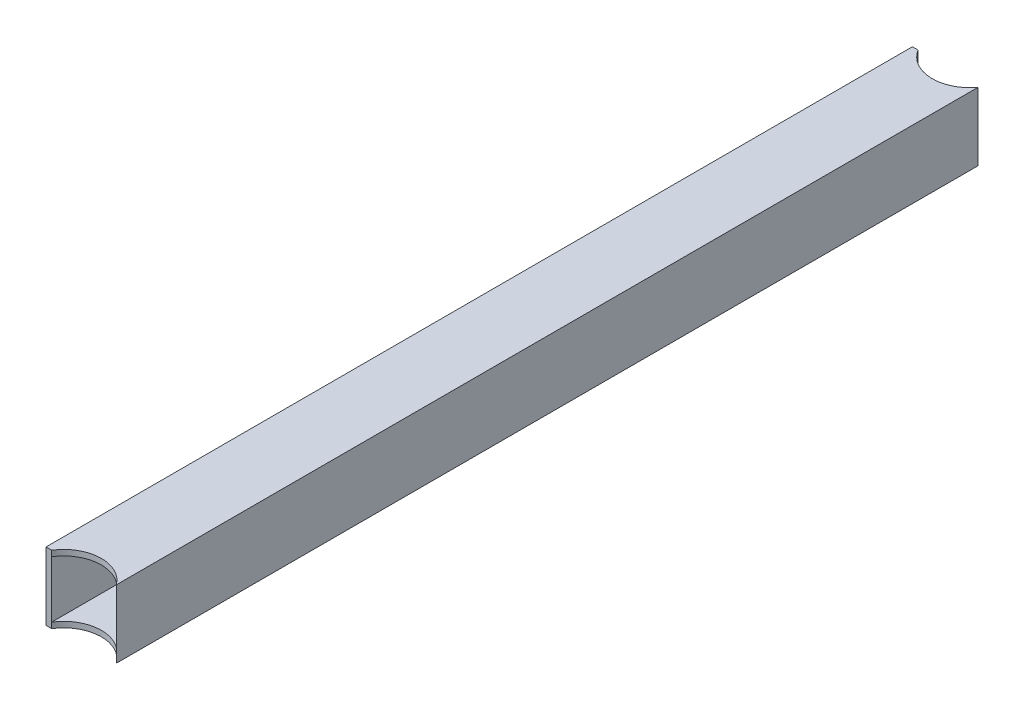
ISO-10303-21;
HEADER;
FILE_DESCRIPTION(('STEP AP214'),'2;1');
FILE_NAME('part.step','',(''),(''),'','','');
FILE_SCHEMA(('AUTOMOTIVE_DESIGN { 1 0 10303 214 1 1 1 1 }'));
ENDSEC;
DATA;
#1=APPLICATION_CONTEXT('core data for automotive mechanical design processes');
#2=APPLICATION_PROTOCOL_DEFINITION('international standard','automotive_design',2000,#1);
#3=PRODUCT_CONTEXT('',#1,'mechanical');
#4=PRODUCT('Part','Part','',(#3));
#5=PRODUCT_RELATED_PRODUCT_CATEGORY('part','',(#4));
#6=PRODUCT_DEFINITION_FORMATION('','',#4);
#7=PRODUCT_DEFINITION_CONTEXT('part definition',#1,'design');
#8=PRODUCT_DEFINITION('design','',#6,#7);
#9=PRODUCT_DEFINITION_SHAPE('','',#8);
#10=(LENGTH_UNIT() NAMED_UNIT(*) SI_UNIT(.MILLI.,.METRE.));
#11=(NAMED_UNIT(*) PLANE_ANGLE_UNIT() SI_UNIT($,.RADIAN.));
#12=(NAMED_UNIT(*) SI_UNIT($,.STERADIAN.) SOLID_ANGLE_UNIT());
#13=UNCERTAINTY_MEASURE_WITH_UNIT(LENGTH_MEASURE(1.E-05),#10,'distance_accuracy_value','');
#14=(GEOMETRIC_REPRESENTATION_CONTEXT(3) GLOBAL_UNCERTAINTY_ASSIGNED_CONTEXT((#13)) GLOBAL_UNIT_ASSIGNED_CONTEXT((#10,
#11,#12)) REPRESENTATION_CONTEXT('',''));
#15=CARTESIAN_POINT('',(0.,0.,0.));
#16=DIRECTION('',(0.,0.,1.));
#17=DIRECTION('',(1.,0.,0.));
#18=AXIS2_PLACEMENT_3D('',#15,#16,#17);
#19=CARTESIAN_POINT('',(21.082,0.,254.));
#20=DIRECTION('',(0.,1.,0.));
#21=DIRECTION('',(0.,0.,1.));
#22=AXIS2_PLACEMENT_3D('',#19,#20,#21);
#23=CYLINDRICAL_SURFACE('',#22,21.082);
#24=DIRECTION('',(0.,1.,0.));
#25=VECTOR('',#24,1.);
#26=CARTESIAN_POINT('',(3.17500000000001,0.,242.873901177861));
#27=LINE('',#26,#25);
#28=CARTESIAN_POINT('',(3.17500000000001,3.175,242.873901177861));
#29=VERTEX_POINT('',#28);
#30=CARTESIAN_POINT('',(3.17500000000001,34.925,242.873901177861));
#31=VERTEX_POINT('',#30);
#32=EDGE_CURVE('E150',#29,#31,#27,.T.);
#33=ORIENTED_EDGE('',*,*,#32,.T.);
#34=CARTESIAN_POINT('',(21.082,34.925,254.));
#35=DIRECTION('',(0.,-1.,0.));
#36=DIRECTION('',(0.,0.,-1.));
#37=AXIS2_PLACEMENT_3D('',#34,#35,#36);
#38=CIRCLE('',#37,21.082);
#39=CARTESIAN_POINT('',(34.925,34.925,238.099620287553));
#40=VERTEX_POINT('',#39);
#41=EDGE_CURVE('E11',#31,#40,#38,.T.);
#42=ORIENTED_EDGE('',*,*,#41,.T.);
#43=DIRECTION('',(0.,1.,0.));
#44=VECTOR('',#43,1.);
#45=CARTESIAN_POINT('',(34.925,0.,238.099620287553));
#46=LINE('',#45,#44);
#47=CARTESIAN_POINT('',(34.925,3.175,238.099620287553));
#48=VERTEX_POINT('',#47);
#49=EDGE_CURVE('E154',#40,#48,#46,.F.);
#50=ORIENTED_EDGE('',*,*,#49,.T.);
#51=CARTESIAN_POINT('',(21.082,3.175,254.));
#52=DIRECTION('',(0.,1.,0.));
#53=DIRECTION('',(0.,0.,1.));
#54=AXIS2_PLACEMENT_3D('',#51,#52,#53);
#55=CIRCLE('',#54,21.082);
#56=EDGE_CURVE('E152',#48,#29,#55,.T.);
#57=ORIENTED_EDGE('',*,*,#56,.T.);
#58=EDGE_LOOP('',(#33,#42,#50,#57));
#59=FACE_BOUND('',#58,.T.);
#60=DIRECTION('',(0.,1.,0.));
#61=VECTOR('',#60,1.);
#62=CARTESIAN_POINT('',(3.16655784106909,0.,242.8875));
#63=LINE('',#62,#61);
#64=CARTESIAN_POINT('',(3.16655784106909,0.,242.8875));
#65=VERTEX_POINT('',#64);
#66=CARTESIAN_POINT('',(3.16655784106909,38.1,242.8875));
#67=VERTEX_POINT('',#66);
#68=EDGE_CURVE('E114',#65,#67,#63,.T.);
#69=ORIENTED_EDGE('',*,*,#68,.F.);
#70=CARTESIAN_POINT('',(21.082,0.,254.));
#71=DIRECTION('',(0.,1.,0.));
#72=DIRECTION('',(0.,0.,1.));
#73=AXIS2_PLACEMENT_3D('',#70,#71,#72);
#74=CIRCLE('',#73,21.082);
#75=CARTESIAN_POINT('',(38.1,0.,241.556592106661));
#76=VERTEX_POINT('',#75);
#77=EDGE_CURVE('E122',#76,#65,#74,.T.);
#78=ORIENTED_EDGE('',*,*,#77,.F.);
#79=DIRECTION('',(0.,1.,0.));
#80=VECTOR('',#79,1.);
#81=CARTESIAN_POINT('',(38.1,0.,241.556592106661));
#82=LINE('',#81,#80);
#83=CARTESIAN_POINT('',(38.1,38.1,241.556592106661));
#84=VERTEX_POINT('',#83);
#85=EDGE_CURVE('E147',#84,#76,#82,.F.);
#86=ORIENTED_EDGE('',*,*,#85,.F.);
#87=CARTESIAN_POINT('',(21.082,38.1,254.));
#88=DIRECTION('',(0.,1.,0.));
#89=DIRECTION('',(0.,0.,1.));
#90=AXIS2_PLACEMENT_3D('',#87,#88,#89);
#91=CIRCLE('',#90,21.082);
#92=EDGE_CURVE('E169',#84,#67,#91,.T.);
#93=ORIENTED_EDGE('',*,*,#92,.T.);
#94=EDGE_LOOP('',(#69,#78,#86,#93));
#95=FACE_BOUND('',#94,.T.);
#96=ADVANCED_FACE('F32',(#59,#95),#23,.F.);
#97=CARTESIAN_POINT('',(0.,38.1,1270.));
#98=DIRECTION('',(0.,-1.,0.));
#99=DIRECTION('',(0.,0.,-1.));
#100=AXIS2_PLACEMENT_3D('',#97,#98,#99);
#101=PLANE('',#100);
#102=DIRECTION('',(1.,0.,0.));
#103=VECTOR('',#102,1.);
#104=CARTESIAN_POINT('',(0.,38.1,242.8875));
#105=LINE('',#104,#103);
#106=CARTESIAN_POINT('',(0.,38.1,242.8875));
#107=VERTEX_POINT('',#106);
#108=EDGE_CURVE('E47',#107,#67,#105,.T.);
#109=ORIENTED_EDGE('',*,*,#108,.T.);
#110=ORIENTED_EDGE('',*,*,#92,.F.);
#111=DIRECTION('',(0.,0.,-1.));
#112=VECTOR('',#111,1.);
#113=CARTESIAN_POINT('',(38.1,38.1,1270.));
#114=LINE('',#113,#112);
#115=CARTESIAN_POINT('',(38.1,38.1,-241.556592106662));
#116=VERTEX_POINT('',#115);
#117=EDGE_CURVE('E128',#84,#116,#114,.T.);
#118=ORIENTED_EDGE('',*,*,#117,.T.);
#119=CARTESIAN_POINT('',(21.0819999999997,38.1,-254.));
#120=DIRECTION('',(0.,1.,0.));
#121=DIRECTION('',(0.,0.,-1.));
#122=AXIS2_PLACEMENT_3D('',#119,#120,#121);
#123=CIRCLE('',#122,21.0819999999999);
#124=CARTESIAN_POINT('',(3.16655784106884,38.1,-242.8875));
#125=VERTEX_POINT('',#124);
#126=EDGE_CURVE('E165',#125,#116,#123,.T.);
#127=ORIENTED_EDGE('',*,*,#126,.F.);
#128=DIRECTION('',(1.,0.,0.));
#129=VECTOR('',#128,1.);
#130=CARTESIAN_POINT('',(0.,38.1,-242.8875));
#131=LINE('',#130,#129);
#132=CARTESIAN_POINT('',(0.,38.1,-242.8875));
#133=VERTEX_POINT('',#132);
#134=EDGE_CURVE('E177',#133,#125,#131,.T.);
#135=ORIENTED_EDGE('',*,*,#134,.F.);
#136=DIRECTION('',(0.,0.,-1.));
#137=VECTOR('',#136,1.);
#138=CARTESIAN_POINT('',(0.,38.1,1270.));
#139=LINE('',#138,#137);
#140=EDGE_CURVE('E133',#107,#133,#139,.T.);
#141=ORIENTED_EDGE('',*,*,#140,.F.);
#142=EDGE_LOOP('',(#109,#110,#118,#127,#135,#141));
#143=FACE_BOUND('',#142,.T.);
#144=ADVANCED_FACE('F183',(#143),#101,.F.);
#145=CARTESIAN_POINT('',(0.,0.,1270.));
#146=DIRECTION('',(0.,1.,0.));
#147=DIRECTION('',(0.,0.,1.));
#148=AXIS2_PLACEMENT_3D('',#145,#146,#147);
#149=PLANE('',#148);
#150=DIRECTION('',(1.,0.,0.));
#151=VECTOR('',#150,1.);
#152=CARTESIAN_POINT('',(0.,0.,242.8875));
#153=LINE('',#152,#151);
#154=CARTESIAN_POINT('',(0.,0.,242.8875));
#155=VERTEX_POINT('',#154);
#156=EDGE_CURVE('E108',#155,#65,#153,.T.);
#157=ORIENTED_EDGE('',*,*,#156,.F.);
#158=DIRECTION('',(0.,0.,-1.));
#159=VECTOR('',#158,1.);
#160=CARTESIAN_POINT('',(0.,0.,1270.));
#161=LINE('',#160,#159);
#162=CARTESIAN_POINT('',(0.,0.,-242.887499999999));
#163=VERTEX_POINT('',#162);
#164=EDGE_CURVE('E120',#155,#163,#161,.T.);
#165=ORIENTED_EDGE('',*,*,#164,.T.);
#166=DIRECTION('',(1.,0.,0.));
#167=VECTOR('',#166,1.);
#168=CARTESIAN_POINT('',(0.,0.,-242.8875));
#169=LINE('',#168,#167);
#170=CARTESIAN_POINT('',(3.16655784106884,0.,-242.8875));
#171=VERTEX_POINT('',#170);
#172=EDGE_CURVE('E55',#163,#171,#169,.T.);
#173=ORIENTED_EDGE('',*,*,#172,.T.);
#174=CARTESIAN_POINT('',(21.0819999999997,0.,-254.));
#175=DIRECTION('',(0.,1.,0.));
#176=DIRECTION('',(0.,0.,-1.));
#177=AXIS2_PLACEMENT_3D('',#174,#175,#176);
#178=CIRCLE('',#177,21.0819999999999);
#179=CARTESIAN_POINT('',(38.1,0.,-241.556592106662));
#180=VERTEX_POINT('',#179);
#181=EDGE_CURVE('E167',#171,#180,#178,.T.);
#182=ORIENTED_EDGE('',*,*,#181,.T.);
#183=DIRECTION('',(0.,0.,-1.));
#184=VECTOR('',#183,1.);
#185=CARTESIAN_POINT('',(38.1,0.,1270.));
#186=LINE('',#185,#184);
#187=EDGE_CURVE('E125',#76,#180,#186,.T.);
#188=ORIENTED_EDGE('',*,*,#187,.F.);
#189=ORIENTED_EDGE('',*,*,#77,.T.);
#190=EDGE_LOOP('',(#157,#165,#173,#182,#188,#189));
#191=FACE_BOUND('',#190,.T.);
#192=ADVANCED_FACE('F119',(#191),#149,.F.);
#193=CARTESIAN_POINT('',(0.,0.,1270.));
#194=DIRECTION('',(1.,0.,0.));
#195=DIRECTION('',(0.,0.,-1.));
#196=AXIS2_PLACEMENT_3D('',#193,#194,#195);
#197=PLANE('',#196);
#198=DIRECTION('',(0.,1.,0.));
#199=VECTOR('',#198,1.);
#200=CARTESIAN_POINT('',(0.,0.,242.8875));
#201=LINE('',#200,#199);
#202=EDGE_CURVE('E105',#155,#107,#201,.T.);
#203=ORIENTED_EDGE('',*,*,#202,.T.);
#204=ORIENTED_EDGE('',*,*,#140,.T.);
#205=DIRECTION('',(0.,1.,0.));
#206=VECTOR('',#205,1.);
#207=CARTESIAN_POINT('',(0.,0.,-242.8875));
#208=LINE('',#207,#206);
#209=EDGE_CURVE('E124',#163,#133,#208,.T.);
#210=ORIENTED_EDGE('',*,*,#209,.F.);
#211=ORIENTED_EDGE('',*,*,#164,.F.);
#212=EDGE_LOOP('',(#203,#204,#210,#211));
#213=FACE_BOUND('',#212,.T.);
#214=ADVANCED_FACE('F34',(#213),#197,.F.);
#215=CARTESIAN_POINT('',(3.175,34.925,1270.));
#216=DIRECTION('',(0.,-1.,0.));
#217=DIRECTION('',(0.,0.,-1.));
#218=AXIS2_PLACEMENT_3D('',#215,#216,#217);
#219=PLANE('',#218);
#220=ORIENTED_EDGE('',*,*,#41,.F.);
#221=DIRECTION('',(0.,0.,-1.));
#222=VECTOR('',#221,1.);
#223=CARTESIAN_POINT('',(3.175,34.925,1270.));
#224=LINE('',#223,#222);
#225=CARTESIAN_POINT('',(3.17500000000001,34.925,-242.873901177861));
#226=VERTEX_POINT('',#225);
#227=EDGE_CURVE('E144',#31,#226,#224,.T.);
#228=ORIENTED_EDGE('',*,*,#227,.T.);
#229=CARTESIAN_POINT('',(21.0819999999997,34.925,-254.));
#230=DIRECTION('',(0.,-1.,0.));
#231=DIRECTION('',(0.,0.,-1.));
#232=AXIS2_PLACEMENT_3D('',#229,#230,#231);
#233=CIRCLE('',#232,21.0819999999999);
#234=CARTESIAN_POINT('',(34.925,34.925,-238.099620287553));
#235=VERTEX_POINT('',#234);
#236=EDGE_CURVE('E40',#235,#226,#233,.T.);
#237=ORIENTED_EDGE('',*,*,#236,.F.);
#238=DIRECTION('',(0.,0.,-1.));
#239=VECTOR('',#238,1.);
#240=CARTESIAN_POINT('',(34.925,34.925,1270.));
#241=LINE('',#240,#239);
#242=EDGE_CURVE('E141',#40,#235,#241,.T.);
#243=ORIENTED_EDGE('',*,*,#242,.F.);
#244=EDGE_LOOP('',(#220,#228,#237,#243));
#245=FACE_BOUND('',#244,.T.);
#246=ADVANCED_FACE('F215',(#245),#219,.T.);
#247=CARTESIAN_POINT('',(34.925,3.175,1270.));
#248=DIRECTION('',(-1.,0.,0.));
#249=DIRECTION('',(0.,0.,1.));
#250=AXIS2_PLACEMENT_3D('',#247,#248,#249);
#251=PLANE('',#250);
#252=ORIENTED_EDGE('',*,*,#49,.F.);
#253=ORIENTED_EDGE('',*,*,#242,.T.);
#254=DIRECTION('',(0.,1.,0.));
#255=VECTOR('',#254,1.);
#256=CARTESIAN_POINT('',(34.925,0.,-238.099620287553));
#257=LINE('',#256,#255);
#258=CARTESIAN_POINT('',(34.925,3.175,-238.099620287553));
#259=VERTEX_POINT('',#258);
#260=EDGE_CURVE('E162',#259,#235,#257,.T.);
#261=ORIENTED_EDGE('',*,*,#260,.F.);
#262=DIRECTION('',(0.,0.,-1.));
#263=VECTOR('',#262,1.);
#264=CARTESIAN_POINT('',(34.925,3.175,1270.));
#265=LINE('',#264,#263);
#266=EDGE_CURVE('E138',#48,#259,#265,.T.);
#267=ORIENTED_EDGE('',*,*,#266,.F.);
#268=EDGE_LOOP('',(#252,#253,#261,#267));
#269=FACE_BOUND('',#268,.T.);
#270=ADVANCED_FACE('F218',(#269),#251,.T.);
#271=CARTESIAN_POINT('',(3.175,3.175,1270.));
#272=DIRECTION('',(0.,1.,0.));
#273=DIRECTION('',(0.,0.,1.));
#274=AXIS2_PLACEMENT_3D('',#271,#272,#273);
#275=PLANE('',#274);
#276=ORIENTED_EDGE('',*,*,#56,.F.);
#277=ORIENTED_EDGE('',*,*,#266,.T.);
#278=CARTESIAN_POINT('',(21.0819999999997,3.175,-254.));
#279=DIRECTION('',(0.,1.,0.));
#280=DIRECTION('',(0.,0.,1.));
#281=AXIS2_PLACEMENT_3D('',#278,#279,#280);
#282=CIRCLE('',#281,21.0819999999999);
#283=CARTESIAN_POINT('',(3.17500000000001,3.175,-242.873901177861));
#284=VERTEX_POINT('',#283);
#285=EDGE_CURVE('E161',#284,#259,#282,.T.);
#286=ORIENTED_EDGE('',*,*,#285,.F.);
#287=DIRECTION('',(0.,0.,-1.));
#288=VECTOR('',#287,1.);
#289=CARTESIAN_POINT('',(3.175,3.175,1270.));
#290=LINE('',#289,#288);
#291=EDGE_CURVE('E135',#29,#284,#290,.T.);
#292=ORIENTED_EDGE('',*,*,#291,.F.);
#293=EDGE_LOOP('',(#276,#277,#286,#292));
#294=FACE_BOUND('',#293,.T.);
#295=ADVANCED_FACE('F222',(#294),#275,.T.);
#296=CARTESIAN_POINT('',(3.175,3.175,1270.));
#297=DIRECTION('',(1.,0.,0.));
#298=DIRECTION('',(0.,0.,-1.));
#299=AXIS2_PLACEMENT_3D('',#296,#297,#298);
#300=PLANE('',#299);
#301=ORIENTED_EDGE('',*,*,#32,.F.);
#302=ORIENTED_EDGE('',*,*,#291,.T.);
#303=DIRECTION('',(0.,1.,0.));
#304=VECTOR('',#303,1.);
#305=CARTESIAN_POINT('',(3.17500000000001,0.,-242.873901177861));
#306=LINE('',#305,#304);
#307=EDGE_CURVE('E159',#226,#284,#306,.F.);
#308=ORIENTED_EDGE('',*,*,#307,.F.);
#309=ORIENTED_EDGE('',*,*,#227,.F.);
#310=EDGE_LOOP('',(#301,#302,#308,#309));
#311=FACE_BOUND('',#310,.T.);
#312=ADVANCED_FACE('F214',(#311),#300,.T.);
#313=CARTESIAN_POINT('',(21.0819999999997,0.,-254.));
#314=DIRECTION('',(0.,1.,0.));
#315=DIRECTION('',(0.,0.,1.));
#316=AXIS2_PLACEMENT_3D('',#313,#314,#315);
#317=CYLINDRICAL_SURFACE('',#316,21.0819999999999);
#318=ORIENTED_EDGE('',*,*,#181,.F.);
#319=DIRECTION('',(0.,1.,0.));
#320=VECTOR('',#319,1.);
#321=CARTESIAN_POINT('',(3.16655784106884,0.,-242.8875));
#322=LINE('',#321,#320);
#323=EDGE_CURVE('E174',#171,#125,#322,.T.);
#324=ORIENTED_EDGE('',*,*,#323,.T.);
#325=ORIENTED_EDGE('',*,*,#126,.T.);
#326=DIRECTION('',(0.,1.,0.));
#327=VECTOR('',#326,1.);
#328=CARTESIAN_POINT('',(38.1,0.,-241.556592106662));
#329=LINE('',#328,#327);
#330=EDGE_CURVE('E156',#180,#116,#329,.T.);
#331=ORIENTED_EDGE('',*,*,#330,.F.);
#332=EDGE_LOOP('',(#318,#324,#325,#331));
#333=FACE_BOUND('',#332,.T.);
#334=ORIENTED_EDGE('',*,*,#307,.T.);
#335=ORIENTED_EDGE('',*,*,#285,.T.);
#336=ORIENTED_EDGE('',*,*,#260,.T.);
#337=ORIENTED_EDGE('',*,*,#236,.T.);
#338=EDGE_LOOP('',(#334,#335,#336,#337));
#339=FACE_BOUND('',#338,.T.);
#340=ADVANCED_FACE('F192',(#333,#339),#317,.F.);
#341=CARTESIAN_POINT('',(38.1,0.,1270.));
#342=DIRECTION('',(-1.,0.,0.));
#343=DIRECTION('',(0.,0.,1.));
#344=AXIS2_PLACEMENT_3D('',#341,#342,#343);
#345=PLANE('',#344);
#346=ORIENTED_EDGE('',*,*,#117,.F.);
#347=ORIENTED_EDGE('',*,*,#85,.T.);
#348=ORIENTED_EDGE('',*,*,#187,.T.);
#349=ORIENTED_EDGE('',*,*,#330,.T.);
#350=EDGE_LOOP('',(#346,#347,#348,#349));
#351=FACE_BOUND('',#350,.T.);
#352=ADVANCED_FACE('F188',(#351),#345,.F.);
#353=CARTESIAN_POINT('',(0.,0.,-242.8875));
#354=DIRECTION('',(0.,0.,1.));
#355=DIRECTION('',(1.,0.,0.));
#356=AXIS2_PLACEMENT_3D('',#353,#354,#355);
#357=PLANE('',#356);
#358=ORIENTED_EDGE('',*,*,#134,.T.);
#359=ORIENTED_EDGE('',*,*,#323,.F.);
#360=ORIENTED_EDGE('',*,*,#172,.F.);
#361=ORIENTED_EDGE('',*,*,#209,.T.);
#362=EDGE_LOOP('',(#358,#359,#360,#361));
#363=FACE_BOUND('',#362,.T.);
#364=ADVANCED_FACE('F195',(#363),#357,.F.);
#365=CARTESIAN_POINT('',(0.,0.,242.8875));
#366=DIRECTION('',(0.,0.,1.));
#367=DIRECTION('',(1.,0.,0.));
#368=AXIS2_PLACEMENT_3D('',#365,#366,#367);
#369=PLANE('',#368);
#370=ORIENTED_EDGE('',*,*,#108,.F.);
#371=ORIENTED_EDGE('',*,*,#202,.F.);
#372=ORIENTED_EDGE('',*,*,#156,.T.);
#373=ORIENTED_EDGE('',*,*,#68,.T.);
#374=EDGE_LOOP('',(#370,#371,#372,#373));
#375=FACE_BOUND('',#374,.T.);
#376=ADVANCED_FACE('F107',(#375),#369,.T.);
#377=CLOSED_SHELL('',(#96,#144,#192,#214,#246,#270,#295,#312,#340,#352,#364,#376));
#378=MANIFOLD_SOLID_BREP('B2',#377);
#379=ADVANCED_BREP_SHAPE_REPRESENTATION('',(#18,#378),#14);
#380=SHAPE_DEFINITION_REPRESENTATION(#9,#379);
ENDSEC;
END-ISO-10303-21;
